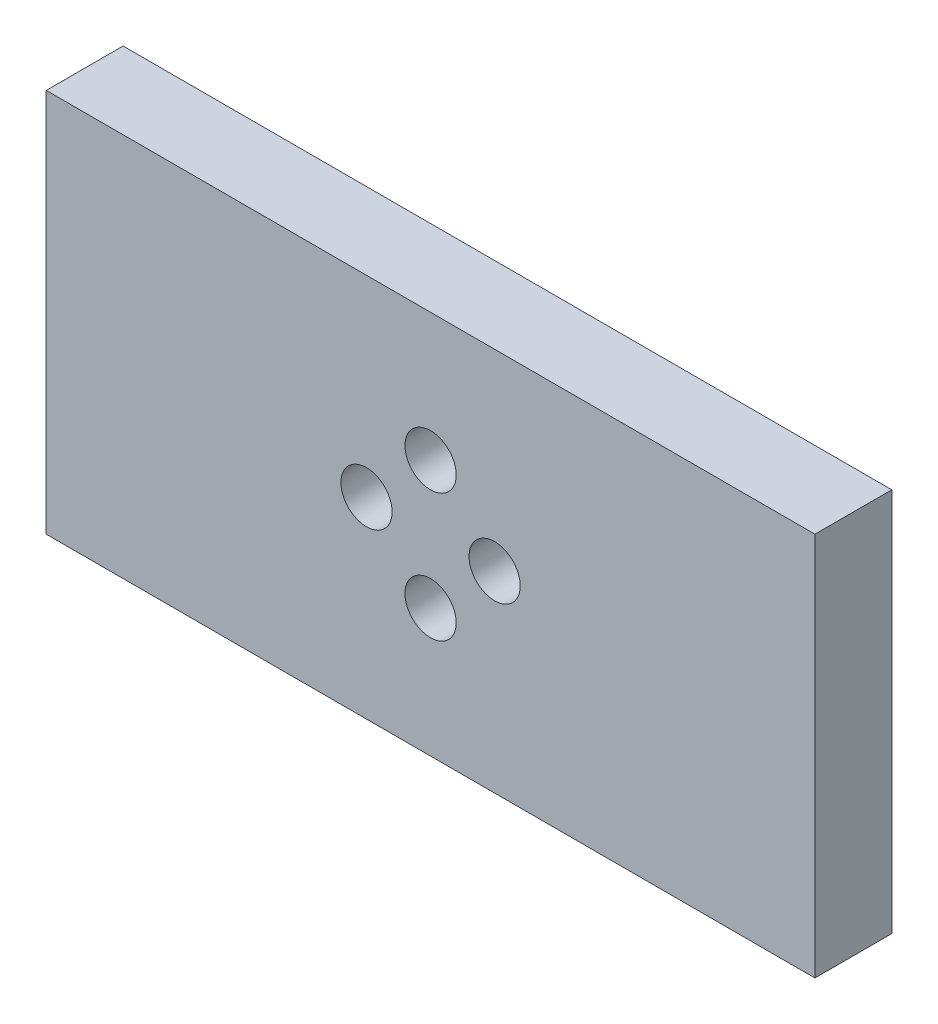
ISO-10303-21;
HEADER;
FILE_DESCRIPTION(('STEP AP214'),'2;1');
FILE_NAME('part.step','',(''),(''),'','','');
FILE_SCHEMA(('AUTOMOTIVE_DESIGN { 1 0 10303 214 1 1 1 1 }'));
ENDSEC;
DATA;
#1=APPLICATION_CONTEXT('core data for automotive mechanical design processes');
#2=APPLICATION_PROTOCOL_DEFINITION('international standard','automotive_design',2000,#1);
#3=PRODUCT_CONTEXT('',#1,'mechanical');
#4=PRODUCT('Part','Part','',(#3));
#5=PRODUCT_RELATED_PRODUCT_CATEGORY('part','',(#4));
#6=PRODUCT_DEFINITION_FORMATION('','',#4);
#7=PRODUCT_DEFINITION_CONTEXT('part definition',#1,'design');
#8=PRODUCT_DEFINITION('design','',#6,#7);
#9=PRODUCT_DEFINITION_SHAPE('','',#8);
#10=(LENGTH_UNIT() NAMED_UNIT(*) SI_UNIT(.MILLI.,.METRE.));
#11=(NAMED_UNIT(*) PLANE_ANGLE_UNIT() SI_UNIT($,.RADIAN.));
#12=(NAMED_UNIT(*) SI_UNIT($,.STERADIAN.) SOLID_ANGLE_UNIT());
#13=UNCERTAINTY_MEASURE_WITH_UNIT(LENGTH_MEASURE(1.E-05),#10,'distance_accuracy_value','');
#14=(GEOMETRIC_REPRESENTATION_CONTEXT(3) GLOBAL_UNCERTAINTY_ASSIGNED_CONTEXT((#13)) GLOBAL_UNIT_ASSIGNED_CONTEXT((#10,
#11,#12)) REPRESENTATION_CONTEXT('',''));
#15=CARTESIAN_POINT('',(0.,0.,0.));
#16=DIRECTION('',(0.,0.,1.));
#17=DIRECTION('',(1.,0.,0.));
#18=AXIS2_PLACEMENT_3D('',#15,#16,#17);
#19=CARTESIAN_POINT('',(15.,-7.5,3.));
#20=DIRECTION('',(-1.,0.,0.));
#21=DIRECTION('',(0.,0.,1.));
#22=AXIS2_PLACEMENT_3D('',#19,#20,#21);
#23=PLANE('',#22);
#24=DIRECTION('',(0.,1.,0.));
#25=VECTOR('',#24,1.);
#26=CARTESIAN_POINT('',(15.,-7.5,0.));
#27=LINE('',#26,#25);
#28=CARTESIAN_POINT('',(15.,-7.5,0.));
#29=VERTEX_POINT('',#28);
#30=CARTESIAN_POINT('',(15.,7.5,0.));
#31=VERTEX_POINT('',#30);
#32=EDGE_CURVE('E107',#29,#31,#27,.T.);
#33=ORIENTED_EDGE('',*,*,#32,.T.);
#34=DIRECTION('',(0.,0.,-1.));
#35=VECTOR('',#34,1.);
#36=CARTESIAN_POINT('',(15.,7.5,3.));
#37=LINE('',#36,#35);
#38=CARTESIAN_POINT('',(15.,7.5,3.));
#39=VERTEX_POINT('',#38);
#40=EDGE_CURVE('E11',#39,#31,#37,.T.);
#41=ORIENTED_EDGE('',*,*,#40,.F.);
#42=DIRECTION('',(0.,1.,0.));
#43=VECTOR('',#42,1.);
#44=CARTESIAN_POINT('',(15.,-7.5,3.));
#45=LINE('',#44,#43);
#46=CARTESIAN_POINT('',(15.,-7.5,3.));
#47=VERTEX_POINT('',#46);
#48=EDGE_CURVE('E94',#47,#39,#45,.T.);
#49=ORIENTED_EDGE('',*,*,#48,.F.);
#50=DIRECTION('',(0.,0.,-1.));
#51=VECTOR('',#50,1.);
#52=CARTESIAN_POINT('',(15.,-7.5,3.));
#53=LINE('',#52,#51);
#54=EDGE_CURVE('E103',#47,#29,#53,.T.);
#55=ORIENTED_EDGE('',*,*,#54,.T.);
#56=EDGE_LOOP('',(#33,#41,#49,#55));
#57=FACE_BOUND('',#56,.T.);
#58=ADVANCED_FACE('F41',(#57),#23,.F.);
#59=CARTESIAN_POINT('',(-15.,7.5,3.));
#60=DIRECTION('',(0.,-1.,0.));
#61=DIRECTION('',(0.,0.,-1.));
#62=AXIS2_PLACEMENT_3D('',#59,#60,#61);
#63=PLANE('',#62);
#64=DIRECTION('',(-1.,0.,0.));
#65=VECTOR('',#64,1.);
#66=CARTESIAN_POINT('',(-15.,7.5,0.));
#67=LINE('',#66,#65);
#68=CARTESIAN_POINT('',(-15.,7.5,0.));
#69=VERTEX_POINT('',#68);
#70=EDGE_CURVE('E98',#31,#69,#67,.T.);
#71=ORIENTED_EDGE('',*,*,#70,.T.);
#72=DIRECTION('',(0.,0.,-1.));
#73=VECTOR('',#72,1.);
#74=CARTESIAN_POINT('',(-15.,7.5,3.));
#75=LINE('',#74,#73);
#76=CARTESIAN_POINT('',(-15.,7.5,3.));
#77=VERTEX_POINT('',#76);
#78=EDGE_CURVE('E50',#77,#69,#75,.T.);
#79=ORIENTED_EDGE('',*,*,#78,.F.);
#80=DIRECTION('',(-1.,0.,0.));
#81=VECTOR('',#80,1.);
#82=CARTESIAN_POINT('',(-15.,7.5,3.));
#83=LINE('',#82,#81);
#84=EDGE_CURVE('E89',#39,#77,#83,.T.);
#85=ORIENTED_EDGE('',*,*,#84,.F.);
#86=ORIENTED_EDGE('',*,*,#40,.T.);
#87=EDGE_LOOP('',(#71,#79,#85,#86));
#88=FACE_BOUND('',#87,.T.);
#89=ADVANCED_FACE('F97',(#88),#63,.F.);
#90=CARTESIAN_POINT('',(-15.,-7.5,3.));
#91=DIRECTION('',(1.,0.,0.));
#92=DIRECTION('',(0.,0.,-1.));
#93=AXIS2_PLACEMENT_3D('',#90,#91,#92);
#94=PLANE('',#93);
#95=DIRECTION('',(0.,-1.,0.));
#96=VECTOR('',#95,1.);
#97=CARTESIAN_POINT('',(-15.,-7.5,0.));
#98=LINE('',#97,#96);
#99=CARTESIAN_POINT('',(-15.,-7.5,0.));
#100=VERTEX_POINT('',#99);
#101=EDGE_CURVE('E76',#69,#100,#98,.T.);
#102=ORIENTED_EDGE('',*,*,#101,.T.);
#103=DIRECTION('',(0.,0.,-1.));
#104=VECTOR('',#103,1.);
#105=CARTESIAN_POINT('',(-15.,-7.5,3.));
#106=LINE('',#105,#104);
#107=CARTESIAN_POINT('',(-15.,-7.5,3.));
#108=VERTEX_POINT('',#107);
#109=EDGE_CURVE('E99',#108,#100,#106,.T.);
#110=ORIENTED_EDGE('',*,*,#109,.F.);
#111=DIRECTION('',(0.,-1.,0.));
#112=VECTOR('',#111,1.);
#113=CARTESIAN_POINT('',(-15.,-7.5,3.));
#114=LINE('',#113,#112);
#115=EDGE_CURVE('E92',#77,#108,#114,.T.);
#116=ORIENTED_EDGE('',*,*,#115,.F.);
#117=ORIENTED_EDGE('',*,*,#78,.T.);
#118=EDGE_LOOP('',(#102,#110,#116,#117));
#119=FACE_BOUND('',#118,.T.);
#120=ADVANCED_FACE('F101',(#119),#94,.F.);
#121=CARTESIAN_POINT('',(-15.,-7.5,3.));
#122=DIRECTION('',(0.,1.,0.));
#123=DIRECTION('',(0.,0.,1.));
#124=AXIS2_PLACEMENT_3D('',#121,#122,#123);
#125=PLANE('',#124);
#126=DIRECTION('',(1.,0.,0.));
#127=VECTOR('',#126,1.);
#128=CARTESIAN_POINT('',(-15.,-7.5,0.));
#129=LINE('',#128,#127);
#130=EDGE_CURVE('E82',#100,#29,#129,.T.);
#131=ORIENTED_EDGE('',*,*,#130,.T.);
#132=ORIENTED_EDGE('',*,*,#54,.F.);
#133=DIRECTION('',(1.,0.,0.));
#134=VECTOR('',#133,1.);
#135=CARTESIAN_POINT('',(-15.,-7.5,3.));
#136=LINE('',#135,#134);
#137=EDGE_CURVE('E59',#108,#47,#136,.T.);
#138=ORIENTED_EDGE('',*,*,#137,.F.);
#139=ORIENTED_EDGE('',*,*,#109,.T.);
#140=EDGE_LOOP('',(#131,#132,#138,#139));
#141=FACE_BOUND('',#140,.T.);
#142=ADVANCED_FACE('F143',(#141),#125,.F.);
#143=CARTESIAN_POINT('',(0.,0.,3.));
#144=DIRECTION('',(0.,0.,-1.));
#145=DIRECTION('',(-1.,0.,0.));
#146=AXIS2_PLACEMENT_3D('',#143,#144,#145);
#147=PLANE('',#146);
#148=CARTESIAN_POINT('',(0.,2.5,3.));
#149=DIRECTION('',(0.,0.,1.));
#150=DIRECTION('',(1.,0.,0.));
#151=AXIS2_PLACEMENT_3D('',#148,#149,#150);
#152=CIRCLE('',#151,1.);
#153=CARTESIAN_POINT('',(1.,2.5,3.));
#154=VERTEX_POINT('',#153);
#155=EDGE_CURVE('E119',#154,#154,#152,.T.);
#156=ORIENTED_EDGE('',*,*,#155,.F.);
#157=EDGE_LOOP('',(#156));
#158=FACE_BOUND('',#157,.T.);
#159=CARTESIAN_POINT('',(2.50000000000007,0.,3.));
#160=DIRECTION('',(0.,0.,1.));
#161=DIRECTION('',(1.,0.,0.));
#162=AXIS2_PLACEMENT_3D('',#159,#160,#161);
#163=CIRCLE('',#162,1.00000000000006);
#164=CARTESIAN_POINT('',(3.50000000000013,0.,3.));
#165=VERTEX_POINT('',#164);
#166=EDGE_CURVE('E248',#165,#165,#163,.T.);
#167=ORIENTED_EDGE('',*,*,#166,.F.);
#168=EDGE_LOOP('',(#167));
#169=FACE_BOUND('',#168,.T.);
#170=CARTESIAN_POINT('',(1.4119006205266E-13,-2.5,3.));
#171=DIRECTION('',(0.,0.,1.));
#172=DIRECTION('',(1.,0.,0.));
#173=AXIS2_PLACEMENT_3D('',#170,#171,#172);
#174=CIRCLE('',#173,1.00000000000015);
#175=CARTESIAN_POINT('',(1.00000000000029,-2.5,3.));
#176=VERTEX_POINT('',#175);
#177=EDGE_CURVE('E250',#176,#176,#174,.T.);
#178=ORIENTED_EDGE('',*,*,#177,.F.);
#179=EDGE_LOOP('',(#178));
#180=FACE_BOUND('',#179,.T.);
#181=CARTESIAN_POINT('',(-2.49999999999993,0.,3.));
#182=DIRECTION('',(0.,0.,1.));
#183=DIRECTION('',(1.,0.,0.));
#184=AXIS2_PLACEMENT_3D('',#181,#182,#183);
#185=CIRCLE('',#184,1.00000000000011);
#186=CARTESIAN_POINT('',(-1.49999999999982,0.,3.));
#187=VERTEX_POINT('',#186);
#188=EDGE_CURVE('E255',#187,#187,#185,.T.);
#189=ORIENTED_EDGE('',*,*,#188,.F.);
#190=EDGE_LOOP('',(#189));
#191=FACE_BOUND('',#190,.T.);
#192=ORIENTED_EDGE('',*,*,#48,.T.);
#193=ORIENTED_EDGE('',*,*,#84,.T.);
#194=ORIENTED_EDGE('',*,*,#115,.T.);
#195=ORIENTED_EDGE('',*,*,#137,.T.);
#196=EDGE_LOOP('',(#192,#193,#194,#195));
#197=FACE_BOUND('',#196,.T.);
#198=ADVANCED_FACE('F90',(#158,#169,#180,#191,#197),#147,.F.);
#199=CARTESIAN_POINT('',(0.,0.,0.));
#200=DIRECTION('',(0.,0.,-1.));
#201=DIRECTION('',(-1.,0.,0.));
#202=AXIS2_PLACEMENT_3D('',#199,#200,#201);
#203=PLANE('',#202);
#204=CARTESIAN_POINT('',(0.,2.5,0.));
#205=DIRECTION('',(0.,0.,-1.));
#206=DIRECTION('',(-1.,0.,0.));
#207=AXIS2_PLACEMENT_3D('',#204,#205,#206);
#208=CIRCLE('',#207,1.);
#209=CARTESIAN_POINT('',(-1.,2.5,0.));
#210=VERTEX_POINT('',#209);
#211=EDGE_CURVE('E44',#210,#210,#208,.T.);
#212=ORIENTED_EDGE('',*,*,#211,.F.);
#213=EDGE_LOOP('',(#212));
#214=FACE_BOUND('',#213,.T.);
#215=CARTESIAN_POINT('',(2.50000000000007,0.,0.));
#216=DIRECTION('',(0.,0.,-1.));
#217=DIRECTION('',(-1.,0.,0.));
#218=AXIS2_PLACEMENT_3D('',#215,#216,#217);
#219=CIRCLE('',#218,1.00000000000006);
#220=CARTESIAN_POINT('',(1.50000000000002,0.,0.));
#221=VERTEX_POINT('',#220);
#222=EDGE_CURVE('E121',#221,#221,#219,.T.);
#223=ORIENTED_EDGE('',*,*,#222,.F.);
#224=EDGE_LOOP('',(#223));
#225=FACE_BOUND('',#224,.T.);
#226=CARTESIAN_POINT('',(1.4119006205266E-13,-2.5,0.));
#227=DIRECTION('',(0.,0.,-1.));
#228=DIRECTION('',(-1.,0.,0.));
#229=AXIS2_PLACEMENT_3D('',#226,#227,#228);
#230=CIRCLE('',#229,1.00000000000015);
#231=CARTESIAN_POINT('',(-1.00000000000001,-2.5,0.));
#232=VERTEX_POINT('',#231);
#233=EDGE_CURVE('E118',#232,#232,#230,.T.);
#234=ORIENTED_EDGE('',*,*,#233,.F.);
#235=EDGE_LOOP('',(#234));
#236=FACE_BOUND('',#235,.T.);
#237=CARTESIAN_POINT('',(-2.49999999999993,0.,0.));
#238=DIRECTION('',(0.,0.,-1.));
#239=DIRECTION('',(-1.,0.,0.));
#240=AXIS2_PLACEMENT_3D('',#237,#238,#239);
#241=CIRCLE('',#240,1.00000000000011);
#242=CARTESIAN_POINT('',(-3.50000000000004,0.,0.));
#243=VERTEX_POINT('',#242);
#244=EDGE_CURVE('E115',#243,#243,#241,.T.);
#245=ORIENTED_EDGE('',*,*,#244,.F.);
#246=EDGE_LOOP('',(#245));
#247=FACE_BOUND('',#246,.T.);
#248=ORIENTED_EDGE('',*,*,#32,.F.);
#249=ORIENTED_EDGE('',*,*,#130,.F.);
#250=ORIENTED_EDGE('',*,*,#101,.F.);
#251=ORIENTED_EDGE('',*,*,#70,.F.);
#252=EDGE_LOOP('',(#248,#249,#250,#251));
#253=FACE_BOUND('',#252,.T.);
#254=ADVANCED_FACE('F131',(#214,#225,#236,#247,#253),#203,.T.);
#255=CARTESIAN_POINT('',(-2.49999999999993,0.,-7.));
#256=DIRECTION('',(0.,0.,1.));
#257=DIRECTION('',(1.,0.,0.));
#258=AXIS2_PLACEMENT_3D('',#255,#256,#257);
#259=CYLINDRICAL_SURFACE('',#258,1.00000000000011);
#260=ORIENTED_EDGE('',*,*,#244,.T.);
#261=EDGE_LOOP('',(#260));
#262=FACE_BOUND('',#261,.T.);
#263=ORIENTED_EDGE('',*,*,#188,.T.);
#264=EDGE_LOOP('',(#263));
#265=FACE_BOUND('',#264,.T.);
#266=ADVANCED_FACE('F134',(#262,#265),#259,.F.);
#267=CARTESIAN_POINT('',(1.4119006205266E-13,-2.5,-7.));
#268=DIRECTION('',(0.,0.,1.));
#269=DIRECTION('',(1.,0.,0.));
#270=AXIS2_PLACEMENT_3D('',#267,#268,#269);
#271=CYLINDRICAL_SURFACE('',#270,1.00000000000015);
#272=ORIENTED_EDGE('',*,*,#233,.T.);
#273=EDGE_LOOP('',(#272));
#274=FACE_BOUND('',#273,.T.);
#275=ORIENTED_EDGE('',*,*,#177,.T.);
#276=EDGE_LOOP('',(#275));
#277=FACE_BOUND('',#276,.T.);
#278=ADVANCED_FACE('F186',(#274,#277),#271,.F.);
#279=CARTESIAN_POINT('',(2.50000000000007,0.,-7.));
#280=DIRECTION('',(0.,0.,1.));
#281=DIRECTION('',(1.,0.,0.));
#282=AXIS2_PLACEMENT_3D('',#279,#280,#281);
#283=CYLINDRICAL_SURFACE('',#282,1.00000000000006);
#284=ORIENTED_EDGE('',*,*,#222,.T.);
#285=EDGE_LOOP('',(#284));
#286=FACE_BOUND('',#285,.T.);
#287=ORIENTED_EDGE('',*,*,#166,.T.);
#288=EDGE_LOOP('',(#287));
#289=FACE_BOUND('',#288,.T.);
#290=ADVANCED_FACE('F197',(#286,#289),#283,.F.);
#291=CARTESIAN_POINT('',(0.,2.5,-7.));
#292=DIRECTION('',(0.,0.,1.));
#293=DIRECTION('',(1.,0.,0.));
#294=AXIS2_PLACEMENT_3D('',#291,#292,#293);
#295=CYLINDRICAL_SURFACE('',#294,1.);
#296=ORIENTED_EDGE('',*,*,#211,.T.);
#297=EDGE_LOOP('',(#296));
#298=FACE_BOUND('',#297,.T.);
#299=ORIENTED_EDGE('',*,*,#155,.T.);
#300=EDGE_LOOP('',(#299));
#301=FACE_BOUND('',#300,.T.);
#302=ADVANCED_FACE('F128',(#298,#301),#295,.F.);
#303=CLOSED_SHELL('',(#58,#89,#120,#142,#198,#254,#266,#278,#290,#302));
#304=MANIFOLD_SOLID_BREP('B2',#303);
#305=ADVANCED_BREP_SHAPE_REPRESENTATION('',(#18,#304),#14);
#306=SHAPE_DEFINITION_REPRESENTATION(#9,#305);
ENDSEC;
END-ISO-10303-21;
